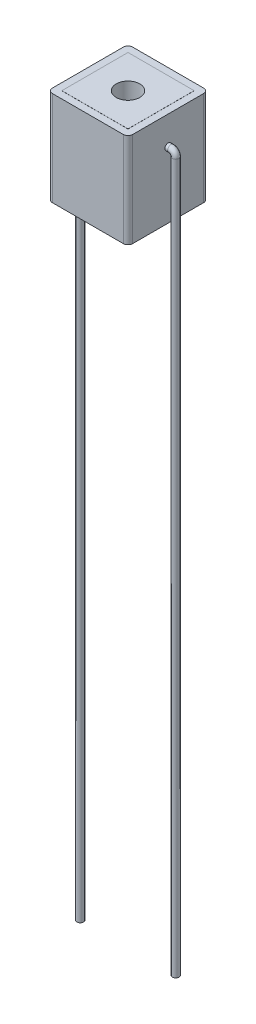
ISO-10303-21;
HEADER;
FILE_DESCRIPTION(('STEP AP214'),'2;1');
FILE_NAME('part.step','',(''),(''),'','','');
FILE_SCHEMA(('AUTOMOTIVE_DESIGN { 1 0 10303 214 1 1 1 1 }'));
ENDSEC;
DATA;
#1=APPLICATION_CONTEXT('core data for automotive mechanical design processes');
#2=APPLICATION_PROTOCOL_DEFINITION('international standard','automotive_design',2000,#1);
#3=PRODUCT_CONTEXT('',#1,'mechanical');
#4=PRODUCT('Part','Part','',(#3));
#5=PRODUCT_RELATED_PRODUCT_CATEGORY('part','',(#4));
#6=PRODUCT_DEFINITION_FORMATION('','',#4);
#7=PRODUCT_DEFINITION_CONTEXT('part definition',#1,'design');
#8=PRODUCT_DEFINITION('design','',#6,#7);
#9=PRODUCT_DEFINITION_SHAPE('','',#8);
#10=(LENGTH_UNIT() NAMED_UNIT(*) SI_UNIT(.MILLI.,.METRE.));
#11=(NAMED_UNIT(*) PLANE_ANGLE_UNIT() SI_UNIT($,.RADIAN.));
#12=(NAMED_UNIT(*) SI_UNIT($,.STERADIAN.) SOLID_ANGLE_UNIT());
#13=UNCERTAINTY_MEASURE_WITH_UNIT(LENGTH_MEASURE(1.E-05),#10,'distance_accuracy_value','');
#14=(GEOMETRIC_REPRESENTATION_CONTEXT(3) GLOBAL_UNCERTAINTY_ASSIGNED_CONTEXT((#13)) GLOBAL_UNIT_ASSIGNED_CONTEXT((#10,
#11,#12)) REPRESENTATION_CONTEXT('',''));
#15=CARTESIAN_POINT('',(0.,0.,0.));
#16=DIRECTION('',(0.,0.,1.));
#17=DIRECTION('',(1.,0.,0.));
#18=AXIS2_PLACEMENT_3D('',#15,#16,#17);
#19=CARTESIAN_POINT('',(4.25,10.,-4.25));
#20=DIRECTION('',(-1.,0.,0.));
#21=DIRECTION('',(0.,0.,1.));
#22=AXIS2_PLACEMENT_3D('',#19,#20,#21);
#23=PLANE('',#22);
#24=CARTESIAN_POINT('',(4.25,7.,0.));
#25=DIRECTION('',(-1.,0.,0.));
#26=DIRECTION('',(0.,0.,1.));
#27=AXIS2_PLACEMENT_3D('',#24,#25,#26);
#28=CIRCLE('',#27,0.35);
#29=CARTESIAN_POINT('',(4.25,7.,0.35));
#30=VERTEX_POINT('',#29);
#31=EDGE_CURVE('E86',#30,#30,#28,.F.);
#32=ORIENTED_EDGE('',*,*,#31,.F.);
#33=EDGE_LOOP('',(#32));
#34=FACE_BOUND('',#33,.T.);
#35=DIRECTION('',(0.,0.,-1.));
#36=VECTOR('',#35,1.);
#37=CARTESIAN_POINT('',(4.25,10.,-4.25));
#38=LINE('',#37,#36);
#39=CARTESIAN_POINT('',(4.25,10.,3.75));
#40=VERTEX_POINT('',#39);
#41=CARTESIAN_POINT('',(4.25,10.,-3.75));
#42=VERTEX_POINT('',#41);
#43=EDGE_CURVE('E299',#40,#42,#38,.T.);
#44=ORIENTED_EDGE('',*,*,#43,.F.);
#45=DIRECTION('',(0.,-1.,0.));
#46=VECTOR('',#45,1.);
#47=CARTESIAN_POINT('',(4.25,10.,3.75));
#48=LINE('',#47,#46);
#49=CARTESIAN_POINT('',(4.25,0.,3.75));
#50=VERTEX_POINT('',#49);
#51=EDGE_CURVE('E345',#40,#50,#48,.T.);
#52=ORIENTED_EDGE('',*,*,#51,.T.);
#53=DIRECTION('',(0.,0.,-1.));
#54=VECTOR('',#53,1.);
#55=CARTESIAN_POINT('',(4.25,0.,-4.25));
#56=LINE('',#55,#54);
#57=CARTESIAN_POINT('',(4.25,0.,-3.75));
#58=VERTEX_POINT('',#57);
#59=EDGE_CURVE('E298',#50,#58,#56,.T.);
#60=ORIENTED_EDGE('',*,*,#59,.T.);
#61=DIRECTION('',(0.,-1.,0.));
#62=VECTOR('',#61,1.);
#63=CARTESIAN_POINT('',(4.25,10.,-3.75));
#64=LINE('',#63,#62);
#65=EDGE_CURVE('E342',#58,#42,#64,.F.);
#66=ORIENTED_EDGE('',*,*,#65,.T.);
#67=EDGE_LOOP('',(#44,#52,#60,#66));
#68=FACE_BOUND('',#67,.T.);
#69=ADVANCED_FACE('F77',(#34,#68),#23,.F.);
#70=CARTESIAN_POINT('',(-4.25,10.,-4.25));
#71=DIRECTION('',(0.,0.,1.));
#72=DIRECTION('',(1.,0.,0.));
#73=AXIS2_PLACEMENT_3D('',#70,#71,#72);
#74=PLANE('',#73);
#75=DIRECTION('',(-1.,0.,0.));
#76=VECTOR('',#75,1.);
#77=CARTESIAN_POINT('',(-4.25,0.,-4.25));
#78=LINE('',#77,#76);
#79=CARTESIAN_POINT('',(3.75,0.,-4.25));
#80=VERTEX_POINT('',#79);
#81=CARTESIAN_POINT('',(-3.75,0.,-4.25));
#82=VERTEX_POINT('',#81);
#83=EDGE_CURVE('E317',#80,#82,#78,.T.);
#84=ORIENTED_EDGE('',*,*,#83,.T.);
#85=DIRECTION('',(0.,-1.,0.));
#86=VECTOR('',#85,1.);
#87=CARTESIAN_POINT('',(-3.75,10.,-4.25));
#88=LINE('',#87,#86);
#89=CARTESIAN_POINT('',(-3.75,10.,-4.25));
#90=VERTEX_POINT('',#89);
#91=EDGE_CURVE('E389',#82,#90,#88,.F.);
#92=ORIENTED_EDGE('',*,*,#91,.T.);
#93=DIRECTION('',(-1.,0.,0.));
#94=VECTOR('',#93,1.);
#95=CARTESIAN_POINT('',(-4.25,10.,-4.25));
#96=LINE('',#95,#94);
#97=CARTESIAN_POINT('',(3.75,10.,-4.25));
#98=VERTEX_POINT('',#97);
#99=EDGE_CURVE('E303',#98,#90,#96,.T.);
#100=ORIENTED_EDGE('',*,*,#99,.F.);
#101=DIRECTION('',(0.,-1.,0.));
#102=VECTOR('',#101,1.);
#103=CARTESIAN_POINT('',(3.75,10.,-4.25));
#104=LINE('',#103,#102);
#105=EDGE_CURVE('E385',#98,#80,#104,.T.);
#106=ORIENTED_EDGE('',*,*,#105,.T.);
#107=EDGE_LOOP('',(#84,#92,#100,#106));
#108=FACE_BOUND('',#107,.T.);
#109=ADVANCED_FACE('F399',(#108),#74,.F.);
#110=CARTESIAN_POINT('',(-4.25,10.,-4.25));
#111=DIRECTION('',(1.,0.,0.));
#112=DIRECTION('',(0.,0.,-1.));
#113=AXIS2_PLACEMENT_3D('',#110,#111,#112);
#114=PLANE('',#113);
#115=CARTESIAN_POINT('',(-4.25,7.,0.));
#116=DIRECTION('',(1.,0.,0.));
#117=DIRECTION('',(0.,0.,-1.));
#118=AXIS2_PLACEMENT_3D('',#115,#116,#117);
#119=CIRCLE('',#118,0.35);
#120=CARTESIAN_POINT('',(-4.25,7.,-0.35));
#121=VERTEX_POINT('',#120);
#122=EDGE_CURVE('E14',#121,#121,#119,.F.);
#123=ORIENTED_EDGE('',*,*,#122,.F.);
#124=EDGE_LOOP('',(#123));
#125=FACE_BOUND('',#124,.T.);
#126=DIRECTION('',(0.,0.,1.));
#127=VECTOR('',#126,1.);
#128=CARTESIAN_POINT('',(-4.25,0.,-4.25));
#129=LINE('',#128,#127);
#130=CARTESIAN_POINT('',(-4.25,0.,-3.75));
#131=VERTEX_POINT('',#130);
#132=CARTESIAN_POINT('',(-4.25,0.,3.75));
#133=VERTEX_POINT('',#132);
#134=EDGE_CURVE('E321',#131,#133,#129,.T.);
#135=ORIENTED_EDGE('',*,*,#134,.T.);
#136=DIRECTION('',(0.,-1.,0.));
#137=VECTOR('',#136,1.);
#138=CARTESIAN_POINT('',(-4.25,10.,3.75));
#139=LINE('',#138,#137);
#140=CARTESIAN_POINT('',(-4.25,10.,3.75));
#141=VERTEX_POINT('',#140);
#142=EDGE_CURVE('E93',#133,#141,#139,.F.);
#143=ORIENTED_EDGE('',*,*,#142,.T.);
#144=DIRECTION('',(0.,0.,1.));
#145=VECTOR('',#144,1.);
#146=CARTESIAN_POINT('',(-4.25,10.,-4.25));
#147=LINE('',#146,#145);
#148=CARTESIAN_POINT('',(-4.25,10.,-3.75));
#149=VERTEX_POINT('',#148);
#150=EDGE_CURVE('E306',#149,#141,#147,.T.);
#151=ORIENTED_EDGE('',*,*,#150,.F.);
#152=DIRECTION('',(0.,-1.,0.));
#153=VECTOR('',#152,1.);
#154=CARTESIAN_POINT('',(-4.25,10.,-3.75));
#155=LINE('',#154,#153);
#156=EDGE_CURVE('E379',#149,#131,#155,.T.);
#157=ORIENTED_EDGE('',*,*,#156,.T.);
#158=EDGE_LOOP('',(#135,#143,#151,#157));
#159=FACE_BOUND('',#158,.T.);
#160=ADVANCED_FACE('F421',(#125,#159),#114,.F.);
#161=CARTESIAN_POINT('',(-4.25,10.,4.25));
#162=DIRECTION('',(0.,0.,-1.));
#163=DIRECTION('',(-1.,0.,0.));
#164=AXIS2_PLACEMENT_3D('',#161,#162,#163);
#165=PLANE('',#164);
#166=DIRECTION('',(1.,0.,0.));
#167=VECTOR('',#166,1.);
#168=CARTESIAN_POINT('',(-4.25,0.,4.25));
#169=LINE('',#168,#167);
#170=CARTESIAN_POINT('',(-3.75,0.,4.25));
#171=VERTEX_POINT('',#170);
#172=CARTESIAN_POINT('',(3.75,0.,4.25));
#173=VERTEX_POINT('',#172);
#174=EDGE_CURVE('E304',#171,#173,#169,.T.);
#175=ORIENTED_EDGE('',*,*,#174,.T.);
#176=DIRECTION('',(0.,-1.,0.));
#177=VECTOR('',#176,1.);
#178=CARTESIAN_POINT('',(3.75,10.,4.25));
#179=LINE('',#178,#177);
#180=CARTESIAN_POINT('',(3.75,10.,4.25));
#181=VERTEX_POINT('',#180);
#182=EDGE_CURVE('E365',#173,#181,#179,.F.);
#183=ORIENTED_EDGE('',*,*,#182,.T.);
#184=DIRECTION('',(1.,0.,0.));
#185=VECTOR('',#184,1.);
#186=CARTESIAN_POINT('',(-4.25,10.,4.25));
#187=LINE('',#186,#185);
#188=CARTESIAN_POINT('',(-3.75,10.,4.25));
#189=VERTEX_POINT('',#188);
#190=EDGE_CURVE('E309',#189,#181,#187,.T.);
#191=ORIENTED_EDGE('',*,*,#190,.F.);
#192=DIRECTION('',(0.,-1.,0.));
#193=VECTOR('',#192,1.);
#194=CARTESIAN_POINT('',(-3.75,10.,4.25));
#195=LINE('',#194,#193);
#196=EDGE_CURVE('E361',#189,#171,#195,.T.);
#197=ORIENTED_EDGE('',*,*,#196,.T.);
#198=EDGE_LOOP('',(#175,#183,#191,#197));
#199=FACE_BOUND('',#198,.T.);
#200=ADVANCED_FACE('F414',(#199),#165,.F.);
#201=CARTESIAN_POINT('',(0.,10.,0.));
#202=DIRECTION('',(0.,1.,0.));
#203=DIRECTION('',(0.,0.,1.));
#204=AXIS2_PLACEMENT_3D('',#201,#202,#203);
#205=PLANE('',#204);
#206=DIRECTION('',(0.,0.,-1.));
#207=VECTOR('',#206,1.);
#208=CARTESIAN_POINT('',(3.5,10.,0.));
#209=LINE('',#208,#207);
#210=CARTESIAN_POINT('',(3.5,10.,3.5));
#211=VERTEX_POINT('',#210);
#212=CARTESIAN_POINT('',(3.5,10.,-3.5));
#213=VERTEX_POINT('',#212);
#214=EDGE_CURVE('E294',#211,#213,#209,.T.);
#215=ORIENTED_EDGE('',*,*,#214,.F.);
#216=DIRECTION('',(1.,0.,0.));
#217=VECTOR('',#216,1.);
#218=CARTESIAN_POINT('',(0.,10.,3.5));
#219=LINE('',#218,#217);
#220=CARTESIAN_POINT('',(-3.5,10.,3.5));
#221=VERTEX_POINT('',#220);
#222=EDGE_CURVE('E290',#221,#211,#219,.T.);
#223=ORIENTED_EDGE('',*,*,#222,.F.);
#224=DIRECTION('',(0.,0.,1.));
#225=VECTOR('',#224,1.);
#226=CARTESIAN_POINT('',(-3.5,10.,0.));
#227=LINE('',#226,#225);
#228=CARTESIAN_POINT('',(-3.5,10.,-3.5));
#229=VERTEX_POINT('',#228);
#230=EDGE_CURVE('E286',#229,#221,#227,.T.);
#231=ORIENTED_EDGE('',*,*,#230,.F.);
#232=DIRECTION('',(-1.,0.,0.));
#233=VECTOR('',#232,1.);
#234=CARTESIAN_POINT('',(0.,10.,-3.5));
#235=LINE('',#234,#233);
#236=EDGE_CURVE('E268',#213,#229,#235,.T.);
#237=ORIENTED_EDGE('',*,*,#236,.F.);
#238=EDGE_LOOP('',(#215,#223,#231,#237));
#239=FACE_BOUND('',#238,.T.);
#240=ORIENTED_EDGE('',*,*,#190,.T.);
#241=CARTESIAN_POINT('',(3.75,10.,3.75));
#242=DIRECTION('',(0.,1.,0.));
#243=DIRECTION('',(0.,0.,1.));
#244=AXIS2_PLACEMENT_3D('',#241,#242,#243);
#245=CIRCLE('',#244,0.5);
#246=EDGE_CURVE('E376',#181,#40,#245,.T.);
#247=ORIENTED_EDGE('',*,*,#246,.T.);
#248=ORIENTED_EDGE('',*,*,#43,.T.);
#249=CARTESIAN_POINT('',(3.75,10.,-3.75));
#250=DIRECTION('',(0.,1.,0.));
#251=DIRECTION('',(0.,0.,1.));
#252=AXIS2_PLACEMENT_3D('',#249,#250,#251);
#253=CIRCLE('',#252,0.5);
#254=EDGE_CURVE('E368',#42,#98,#253,.T.);
#255=ORIENTED_EDGE('',*,*,#254,.T.);
#256=ORIENTED_EDGE('',*,*,#99,.T.);
#257=CARTESIAN_POINT('',(-3.75,10.,-3.75));
#258=DIRECTION('',(0.,1.,0.));
#259=DIRECTION('',(0.,0.,1.));
#260=AXIS2_PLACEMENT_3D('',#257,#258,#259);
#261=CIRCLE('',#260,0.5);
#262=EDGE_CURVE('E100',#90,#149,#261,.T.);
#263=ORIENTED_EDGE('',*,*,#262,.T.);
#264=ORIENTED_EDGE('',*,*,#150,.T.);
#265=CARTESIAN_POINT('',(-3.75,10.,3.75));
#266=DIRECTION('',(0.,1.,0.));
#267=DIRECTION('',(0.,0.,1.));
#268=AXIS2_PLACEMENT_3D('',#265,#266,#267);
#269=CIRCLE('',#268,0.5);
#270=EDGE_CURVE('E373',#141,#189,#269,.T.);
#271=ORIENTED_EDGE('',*,*,#270,.T.);
#272=EDGE_LOOP('',(#240,#247,#248,#255,#256,#263,#264,#271));
#273=FACE_BOUND('',#272,.T.);
#274=ADVANCED_FACE('F431',(#239,#273),#205,.T.);
#275=CARTESIAN_POINT('',(0.,0.,0.));
#276=DIRECTION('',(0.,1.,0.));
#277=DIRECTION('',(0.,0.,1.));
#278=AXIS2_PLACEMENT_3D('',#275,#276,#277);
#279=PLANE('',#278);
#280=DIRECTION('',(1.,0.,0.));
#281=VECTOR('',#280,1.);
#282=CARTESIAN_POINT('',(0.,0.,3.5));
#283=LINE('',#282,#281);
#284=CARTESIAN_POINT('',(-3.5,0.,3.5));
#285=VERTEX_POINT('',#284);
#286=CARTESIAN_POINT('',(3.5,0.,3.5));
#287=VERTEX_POINT('',#286);
#288=EDGE_CURVE('E334',#285,#287,#283,.T.);
#289=ORIENTED_EDGE('',*,*,#288,.T.);
#290=DIRECTION('',(0.,0.,-1.));
#291=VECTOR('',#290,1.);
#292=CARTESIAN_POINT('',(3.5,0.,0.));
#293=LINE('',#292,#291);
#294=CARTESIAN_POINT('',(3.5,0.,-3.5));
#295=VERTEX_POINT('',#294);
#296=EDGE_CURVE('E338',#287,#295,#293,.T.);
#297=ORIENTED_EDGE('',*,*,#296,.T.);
#298=DIRECTION('',(-1.,0.,0.));
#299=VECTOR('',#298,1.);
#300=CARTESIAN_POINT('',(0.,0.,-3.5));
#301=LINE('',#300,#299);
#302=CARTESIAN_POINT('',(-3.5,0.,-3.5));
#303=VERTEX_POINT('',#302);
#304=EDGE_CURVE('E313',#295,#303,#301,.T.);
#305=ORIENTED_EDGE('',*,*,#304,.T.);
#306=DIRECTION('',(0.,0.,1.));
#307=VECTOR('',#306,1.);
#308=CARTESIAN_POINT('',(-3.5,0.,0.));
#309=LINE('',#308,#307);
#310=EDGE_CURVE('E330',#303,#285,#309,.T.);
#311=ORIENTED_EDGE('',*,*,#310,.T.);
#312=EDGE_LOOP('',(#289,#297,#305,#311));
#313=FACE_BOUND('',#312,.T.);
#314=ORIENTED_EDGE('',*,*,#59,.F.);
#315=CARTESIAN_POINT('',(3.75,0.,3.75));
#316=DIRECTION('',(0.,1.,0.));
#317=DIRECTION('',(0.,0.,1.));
#318=AXIS2_PLACEMENT_3D('',#315,#316,#317);
#319=CIRCLE('',#318,0.5);
#320=EDGE_CURVE('E358',#50,#173,#319,.F.);
#321=ORIENTED_EDGE('',*,*,#320,.T.);
#322=ORIENTED_EDGE('',*,*,#174,.F.);
#323=CARTESIAN_POINT('',(-3.75,0.,3.75));
#324=DIRECTION('',(0.,1.,0.));
#325=DIRECTION('',(0.,0.,1.));
#326=AXIS2_PLACEMENT_3D('',#323,#324,#325);
#327=CIRCLE('',#326,0.5);
#328=EDGE_CURVE('E355',#171,#133,#327,.F.);
#329=ORIENTED_EDGE('',*,*,#328,.T.);
#330=ORIENTED_EDGE('',*,*,#134,.F.);
#331=CARTESIAN_POINT('',(-3.75,0.,-3.75));
#332=DIRECTION('',(0.,1.,0.));
#333=DIRECTION('',(0.,0.,1.));
#334=AXIS2_PLACEMENT_3D('',#331,#332,#333);
#335=CIRCLE('',#334,0.5);
#336=EDGE_CURVE('E352',#131,#82,#335,.F.);
#337=ORIENTED_EDGE('',*,*,#336,.T.);
#338=ORIENTED_EDGE('',*,*,#83,.F.);
#339=CARTESIAN_POINT('',(3.75,0.,-3.75));
#340=DIRECTION('',(0.,1.,0.));
#341=DIRECTION('',(0.,0.,1.));
#342=AXIS2_PLACEMENT_3D('',#339,#340,#341);
#343=CIRCLE('',#342,0.5);
#344=EDGE_CURVE('E349',#80,#58,#343,.F.);
#345=ORIENTED_EDGE('',*,*,#344,.T.);
#346=EDGE_LOOP('',(#314,#321,#322,#329,#330,#337,#338,#345));
#347=FACE_BOUND('',#346,.T.);
#348=ADVANCED_FACE('F412',(#313,#347),#279,.F.);
#349=CARTESIAN_POINT('',(0.,-0.01,0.));
#350=DIRECTION('',(0.,1.,0.));
#351=DIRECTION('',(0.,0.,1.));
#352=AXIS2_PLACEMENT_3D('',#349,#350,#351);
#353=PLANE('',#352);
#354=CARTESIAN_POINT('',(0.,-0.00999999999999959,0.));
#355=DIRECTION('',(0.,1.,0.));
#356=DIRECTION('',(0.,0.,1.));
#357=AXIS2_PLACEMENT_3D('',#354,#355,#356);
#358=CIRCLE('',#357,1.25);
#359=CARTESIAN_POINT('',(0.,-0.00999999999999959,1.25));
#360=VERTEX_POINT('',#359);
#361=EDGE_CURVE('E228',#360,#360,#358,.T.);
#362=ORIENTED_EDGE('',*,*,#361,.T.);
#363=EDGE_LOOP('',(#362));
#364=FACE_BOUND('',#363,.T.);
#365=DIRECTION('',(0.,0.,-1.));
#366=VECTOR('',#365,1.);
#367=CARTESIAN_POINT('',(3.5,-0.01,-3.5));
#368=LINE('',#367,#366);
#369=CARTESIAN_POINT('',(3.5,-0.01,3.5));
#370=VERTEX_POINT('',#369);
#371=CARTESIAN_POINT('',(3.5,-0.01,-3.5));
#372=VERTEX_POINT('',#371);
#373=EDGE_CURVE('E248',#370,#372,#368,.T.);
#374=ORIENTED_EDGE('',*,*,#373,.F.);
#375=DIRECTION('',(1.,0.,0.));
#376=VECTOR('',#375,1.);
#377=CARTESIAN_POINT('',(-3.5,-0.01,3.5));
#378=LINE('',#377,#376);
#379=CARTESIAN_POINT('',(-3.5,-0.01,3.5));
#380=VERTEX_POINT('',#379);
#381=EDGE_CURVE('E259',#380,#370,#378,.T.);
#382=ORIENTED_EDGE('',*,*,#381,.F.);
#383=DIRECTION('',(0.,0.,1.));
#384=VECTOR('',#383,1.);
#385=CARTESIAN_POINT('',(-3.5,-0.01,-3.5));
#386=LINE('',#385,#384);
#387=CARTESIAN_POINT('',(-3.5,-0.01,-3.5));
#388=VERTEX_POINT('',#387);
#389=EDGE_CURVE('E256',#388,#380,#386,.T.);
#390=ORIENTED_EDGE('',*,*,#389,.F.);
#391=DIRECTION('',(-1.,0.,0.));
#392=VECTOR('',#391,1.);
#393=CARTESIAN_POINT('',(-3.5,-0.01,-3.5));
#394=LINE('',#393,#392);
#395=EDGE_CURVE('E252',#372,#388,#394,.T.);
#396=ORIENTED_EDGE('',*,*,#395,.F.);
#397=EDGE_LOOP('',(#374,#382,#390,#396));
#398=FACE_BOUND('',#397,.T.);
#399=ADVANCED_FACE('F439',(#364,#398),#353,.F.);
#400=CARTESIAN_POINT('',(-3.5,-0.01,-3.5));
#401=DIRECTION('',(0.,0.,-1.));
#402=DIRECTION('',(-1.,0.,0.));
#403=AXIS2_PLACEMENT_3D('',#400,#401,#402);
#404=PLANE('',#403);
#405=ORIENTED_EDGE('',*,*,#304,.F.);
#406=DIRECTION('',(0.,1.,0.));
#407=VECTOR('',#406,1.);
#408=CARTESIAN_POINT('',(3.5,-0.01,-3.5));
#409=LINE('',#408,#407);
#410=EDGE_CURVE('E279',#372,#295,#409,.T.);
#411=ORIENTED_EDGE('',*,*,#410,.F.);
#412=ORIENTED_EDGE('',*,*,#395,.T.);
#413=DIRECTION('',(0.,1.,0.));
#414=VECTOR('',#413,1.);
#415=CARTESIAN_POINT('',(-3.5,-0.01,-3.5));
#416=LINE('',#415,#414);
#417=EDGE_CURVE('E275',#388,#303,#416,.T.);
#418=ORIENTED_EDGE('',*,*,#417,.T.);
#419=EDGE_LOOP('',(#405,#411,#412,#418));
#420=FACE_BOUND('',#419,.T.);
#421=ADVANCED_FACE('F551',(#420),#404,.T.);
#422=CARTESIAN_POINT('',(-3.5,-0.01,-3.5));
#423=DIRECTION('',(-1.,0.,0.));
#424=DIRECTION('',(0.,0.,1.));
#425=AXIS2_PLACEMENT_3D('',#422,#423,#424);
#426=PLANE('',#425);
#427=ORIENTED_EDGE('',*,*,#310,.F.);
#428=ORIENTED_EDGE('',*,*,#417,.F.);
#429=ORIENTED_EDGE('',*,*,#389,.T.);
#430=DIRECTION('',(0.,1.,0.));
#431=VECTOR('',#430,1.);
#432=CARTESIAN_POINT('',(-3.5,-0.01,3.5));
#433=LINE('',#432,#431);
#434=EDGE_CURVE('E270',#380,#285,#433,.T.);
#435=ORIENTED_EDGE('',*,*,#434,.T.);
#436=EDGE_LOOP('',(#427,#428,#429,#435));
#437=FACE_BOUND('',#436,.T.);
#438=ADVANCED_FACE('F541',(#437),#426,.T.);
#439=CARTESIAN_POINT('',(-3.5,-0.01,3.5));
#440=DIRECTION('',(0.,0.,1.));
#441=DIRECTION('',(1.,0.,0.));
#442=AXIS2_PLACEMENT_3D('',#439,#440,#441);
#443=PLANE('',#442);
#444=ORIENTED_EDGE('',*,*,#288,.F.);
#445=ORIENTED_EDGE('',*,*,#434,.F.);
#446=ORIENTED_EDGE('',*,*,#381,.T.);
#447=DIRECTION('',(0.,1.,0.));
#448=VECTOR('',#447,1.);
#449=CARTESIAN_POINT('',(3.5,-0.01,3.5));
#450=LINE('',#449,#448);
#451=EDGE_CURVE('E264',#370,#287,#450,.T.);
#452=ORIENTED_EDGE('',*,*,#451,.T.);
#453=EDGE_LOOP('',(#444,#445,#446,#452));
#454=FACE_BOUND('',#453,.T.);
#455=ADVANCED_FACE('F536',(#454),#443,.T.);
#456=CARTESIAN_POINT('',(3.5,-0.01,-3.5));
#457=DIRECTION('',(1.,0.,0.));
#458=DIRECTION('',(0.,0.,-1.));
#459=AXIS2_PLACEMENT_3D('',#456,#457,#458);
#460=PLANE('',#459);
#461=ORIENTED_EDGE('',*,*,#296,.F.);
#462=ORIENTED_EDGE('',*,*,#451,.F.);
#463=ORIENTED_EDGE('',*,*,#373,.T.);
#464=ORIENTED_EDGE('',*,*,#410,.T.);
#465=EDGE_LOOP('',(#461,#462,#463,#464));
#466=FACE_BOUND('',#465,.T.);
#467=ADVANCED_FACE('F530',(#466),#460,.T.);
#468=CARTESIAN_POINT('',(3.5,10.01,3.5));
#469=VERTEX_POINT('',#468);
#470=EDGE_CURVE('E269',#211,#469,#450,.T.);
#471=ORIENTED_EDGE('',*,*,#470,.F.);
#472=ORIENTED_EDGE('',*,*,#214,.T.);
#473=CARTESIAN_POINT('',(3.5,10.01,-3.5));
#474=VERTEX_POINT('',#473);
#475=EDGE_CURVE('E263',#213,#474,#409,.T.);
#476=ORIENTED_EDGE('',*,*,#475,.T.);
#477=DIRECTION('',(0.,0.,-1.));
#478=VECTOR('',#477,1.);
#479=CARTESIAN_POINT('',(3.5,10.01,-3.5));
#480=LINE('',#479,#478);
#481=EDGE_CURVE('E232',#469,#474,#480,.T.);
#482=ORIENTED_EDGE('',*,*,#481,.F.);
#483=EDGE_LOOP('',(#471,#472,#476,#482));
#484=FACE_BOUND('',#483,.T.);
#485=ADVANCED_FACE('F444',(#484),#460,.T.);
#486=CARTESIAN_POINT('',(-3.5,10.01,3.5));
#487=VERTEX_POINT('',#486);
#488=EDGE_CURVE('E274',#221,#487,#433,.T.);
#489=ORIENTED_EDGE('',*,*,#488,.F.);
#490=ORIENTED_EDGE('',*,*,#222,.T.);
#491=ORIENTED_EDGE('',*,*,#470,.T.);
#492=DIRECTION('',(1.,0.,0.));
#493=VECTOR('',#492,1.);
#494=CARTESIAN_POINT('',(-3.5,10.01,3.5));
#495=LINE('',#494,#493);
#496=EDGE_CURVE('E244',#487,#469,#495,.T.);
#497=ORIENTED_EDGE('',*,*,#496,.F.);
#498=EDGE_LOOP('',(#489,#490,#491,#497));
#499=FACE_BOUND('',#498,.T.);
#500=ADVANCED_FACE('F520',(#499),#443,.T.);
#501=CARTESIAN_POINT('',(-3.5,10.01,-3.5));
#502=VERTEX_POINT('',#501);
#503=EDGE_CURVE('E278',#229,#502,#416,.T.);
#504=ORIENTED_EDGE('',*,*,#503,.F.);
#505=ORIENTED_EDGE('',*,*,#230,.T.);
#506=ORIENTED_EDGE('',*,*,#488,.T.);
#507=DIRECTION('',(0.,0.,1.));
#508=VECTOR('',#507,1.);
#509=CARTESIAN_POINT('',(-3.5,10.01,-3.5));
#510=LINE('',#509,#508);
#511=EDGE_CURVE('E240',#502,#487,#510,.T.);
#512=ORIENTED_EDGE('',*,*,#511,.F.);
#513=EDGE_LOOP('',(#504,#505,#506,#512));
#514=FACE_BOUND('',#513,.T.);
#515=ADVANCED_FACE('F514',(#514),#426,.T.);
#516=ORIENTED_EDGE('',*,*,#475,.F.);
#517=ORIENTED_EDGE('',*,*,#236,.T.);
#518=ORIENTED_EDGE('',*,*,#503,.T.);
#519=DIRECTION('',(-1.,0.,0.));
#520=VECTOR('',#519,1.);
#521=CARTESIAN_POINT('',(-3.5,10.01,-3.5));
#522=LINE('',#521,#520);
#523=EDGE_CURVE('E236',#474,#502,#522,.T.);
#524=ORIENTED_EDGE('',*,*,#523,.F.);
#525=EDGE_LOOP('',(#516,#517,#518,#524));
#526=FACE_BOUND('',#525,.T.);
#527=ADVANCED_FACE('F527',(#526),#404,.T.);
#528=CARTESIAN_POINT('',(0.,10.01,0.));
#529=DIRECTION('',(0.,1.,0.));
#530=DIRECTION('',(0.,0.,1.));
#531=AXIS2_PLACEMENT_3D('',#528,#529,#530);
#532=PLANE('',#531);
#533=CARTESIAN_POINT('',(0.,10.01,0.));
#534=DIRECTION('',(0.,1.,0.));
#535=DIRECTION('',(0.,0.,1.));
#536=AXIS2_PLACEMENT_3D('',#533,#534,#535);
#537=CIRCLE('',#536,1.25);
#538=CARTESIAN_POINT('',(0.,10.01,1.25));
#539=VERTEX_POINT('',#538);
#540=EDGE_CURVE('E224',#539,#539,#537,.T.);
#541=ORIENTED_EDGE('',*,*,#540,.F.);
#542=EDGE_LOOP('',(#541));
#543=FACE_BOUND('',#542,.T.);
#544=ORIENTED_EDGE('',*,*,#481,.T.);
#545=ORIENTED_EDGE('',*,*,#523,.T.);
#546=ORIENTED_EDGE('',*,*,#511,.T.);
#547=ORIENTED_EDGE('',*,*,#496,.T.);
#548=EDGE_LOOP('',(#544,#545,#546,#547));
#549=FACE_BOUND('',#548,.T.);
#550=ADVANCED_FACE('F454',(#543,#549),#532,.T.);
#551=CARTESIAN_POINT('',(3.75,10.,3.75));
#552=DIRECTION('',(0.,-1.,0.));
#553=DIRECTION('',(0.,0.,-1.));
#554=AXIS2_PLACEMENT_3D('',#551,#552,#553);
#555=CYLINDRICAL_SURFACE('',#554,0.5);
#556=ORIENTED_EDGE('',*,*,#246,.F.);
#557=ORIENTED_EDGE('',*,*,#182,.F.);
#558=ORIENTED_EDGE('',*,*,#320,.F.);
#559=ORIENTED_EDGE('',*,*,#51,.F.);
#560=EDGE_LOOP('',(#556,#557,#558,#559));
#561=FACE_BOUND('',#560,.T.);
#562=ADVANCED_FACE('F408',(#561),#555,.T.);
#563=CARTESIAN_POINT('',(-3.75,10.,3.75));
#564=DIRECTION('',(0.,-1.,0.));
#565=DIRECTION('',(0.,0.,-1.));
#566=AXIS2_PLACEMENT_3D('',#563,#564,#565);
#567=CYLINDRICAL_SURFACE('',#566,0.5);
#568=ORIENTED_EDGE('',*,*,#270,.F.);
#569=ORIENTED_EDGE('',*,*,#142,.F.);
#570=ORIENTED_EDGE('',*,*,#328,.F.);
#571=ORIENTED_EDGE('',*,*,#196,.F.);
#572=EDGE_LOOP('',(#568,#569,#570,#571));
#573=FACE_BOUND('',#572,.T.);
#574=ADVANCED_FACE('F419',(#573),#567,.T.);
#575=CARTESIAN_POINT('',(-3.75,10.,-3.75));
#576=DIRECTION('',(0.,-1.,0.));
#577=DIRECTION('',(0.,0.,-1.));
#578=AXIS2_PLACEMENT_3D('',#575,#576,#577);
#579=CYLINDRICAL_SURFACE('',#578,0.5);
#580=ORIENTED_EDGE('',*,*,#262,.F.);
#581=ORIENTED_EDGE('',*,*,#91,.F.);
#582=ORIENTED_EDGE('',*,*,#336,.F.);
#583=ORIENTED_EDGE('',*,*,#156,.F.);
#584=EDGE_LOOP('',(#580,#581,#582,#583));
#585=FACE_BOUND('',#584,.T.);
#586=ADVANCED_FACE('F424',(#585),#579,.T.);
#587=CARTESIAN_POINT('',(3.75,10.,-3.75));
#588=DIRECTION('',(0.,-1.,0.));
#589=DIRECTION('',(0.,0.,-1.));
#590=AXIS2_PLACEMENT_3D('',#587,#588,#589);
#591=CYLINDRICAL_SURFACE('',#590,0.5);
#592=ORIENTED_EDGE('',*,*,#254,.F.);
#593=ORIENTED_EDGE('',*,*,#65,.F.);
#594=ORIENTED_EDGE('',*,*,#344,.F.);
#595=ORIENTED_EDGE('',*,*,#105,.F.);
#596=EDGE_LOOP('',(#592,#593,#594,#595));
#597=FACE_BOUND('',#596,.T.);
#598=ADVANCED_FACE('F79',(#597),#591,.T.);
#599=CARTESIAN_POINT('',(0.,-9.99,0.));
#600=DIRECTION('',(0.,1.,0.));
#601=DIRECTION('',(0.,0.,1.));
#602=AXIS2_PLACEMENT_3D('',#599,#600,#601);
#603=CYLINDRICAL_SURFACE('',#602,1.25);
#604=ORIENTED_EDGE('',*,*,#540,.T.);
#605=EDGE_LOOP('',(#604));
#606=FACE_BOUND('',#605,.T.);
#607=ORIENTED_EDGE('',*,*,#361,.F.);
#608=EDGE_LOOP('',(#607));
#609=FACE_BOUND('',#608,.T.);
#610=ADVANCED_FACE('F460',(#606,#609),#603,.F.);
#611=CARTESIAN_POINT('',(5.05000000000001,-68.5,0.));
#612=DIRECTION('',(0.,1.,0.));
#613=DIRECTION('',(-1.,0.,0.));
#614=AXIS2_PLACEMENT_3D('',#611,#612,#613);
#615=PLANE('',#614);
#616=CARTESIAN_POINT('',(5.05000000000001,-68.5,0.));
#617=DIRECTION('',(0.,1.,0.));
#618=DIRECTION('',(-1.,0.,0.));
#619=AXIS2_PLACEMENT_3D('',#616,#617,#618);
#620=CIRCLE('',#619,0.35);
#621=CARTESIAN_POINT('',(4.70000000000001,-68.5,0.));
#622=VERTEX_POINT('',#621);
#623=EDGE_CURVE('E221',#622,#622,#620,.T.);
#624=ORIENTED_EDGE('',*,*,#623,.F.);
#625=EDGE_LOOP('',(#624));
#626=FACE_BOUND('',#625,.T.);
#627=ADVANCED_FACE('F464',(#626),#615,.F.);
#628=CARTESIAN_POINT('',(4.25,7.,0.));
#629=DIRECTION('',(1.,0.,0.));
#630=DIRECTION('',(0.,0.,-1.));
#631=AXIS2_PLACEMENT_3D('',#628,#629,#630);
#632=CYLINDRICAL_SURFACE('',#631,0.35);
#633=CARTESIAN_POINT('',(4.55,7.,0.));
#634=DIRECTION('',(-1.,0.,0.));
#635=DIRECTION('',(0.,-1.,0.));
#636=AXIS2_PLACEMENT_3D('',#633,#634,#635);
#637=CIRCLE('',#636,0.35);
#638=CARTESIAN_POINT('',(4.55,7.35,0.));
#639=VERTEX_POINT('',#638);
#640=EDGE_CURVE('E203',#639,#639,#637,.T.);
#641=ORIENTED_EDGE('',*,*,#640,.T.);
#642=EDGE_LOOP('',(#641));
#643=FACE_BOUND('',#642,.T.);
#644=ORIENTED_EDGE('',*,*,#31,.T.);
#645=EDGE_LOOP('',(#644));
#646=FACE_BOUND('',#645,.T.);
#647=ADVANCED_FACE('F395',(#643,#646),#632,.T.);
#648=CARTESIAN_POINT('',(4.55,6.5,0.));
#649=DIRECTION('',(0.,0.,-1.));
#650=DIRECTION('',(-1.,0.,0.));
#651=AXIS2_PLACEMENT_3D('',#648,#649,#650);
#652=TOROIDAL_SURFACE('',#651,0.5,0.35);
#653=CARTESIAN_POINT('',(5.05000000000001,6.50000000000001,0.));
#654=DIRECTION('',(0.,1.,0.));
#655=DIRECTION('',(-1.,0.,0.));
#656=AXIS2_PLACEMENT_3D('',#653,#654,#655);
#657=CIRCLE('',#656,0.35);
#658=CARTESIAN_POINT('',(5.4,6.50000000000001,0.));
#659=VERTEX_POINT('',#658);
#660=EDGE_CURVE('E210',#659,#659,#657,.T.);
#661=CARTESIAN_POINT('',(4.55,6.5,0.));
#662=DIRECTION('',(0.,0.,-1.));
#663=DIRECTION('',(-1.,0.,0.));
#664=AXIS2_PLACEMENT_3D('',#661,#662,#663);
#665=CIRCLE('',#664,0.85);
#666=EDGE_CURVE('',#639,#659,#665,.T.);
#667=ORIENTED_EDGE('',*,*,#640,.F.);
#668=ORIENTED_EDGE('',*,*,#660,.T.);
#669=ORIENTED_EDGE('',*,*,#666,.T.);
#670=ORIENTED_EDGE('',*,*,#666,.F.);
#671=EDGE_LOOP('',(#667,#669,#668,#670));
#672=FACE_BOUND('',#671,.T.);
#673=ADVANCED_FACE('F477',(#672),#652,.T.);
#674=CARTESIAN_POINT('',(5.05,6.50000000000001,0.));
#675=DIRECTION('',(0.,-1.,0.));
#676=DIRECTION('',(1.,0.,0.));
#677=AXIS2_PLACEMENT_3D('',#674,#675,#676);
#678=CYLINDRICAL_SURFACE('',#677,0.35);
#679=ORIENTED_EDGE('',*,*,#623,.T.);
#680=EDGE_LOOP('',(#679));
#681=FACE_BOUND('',#680,.T.);
#682=ORIENTED_EDGE('',*,*,#660,.F.);
#683=EDGE_LOOP('',(#682));
#684=FACE_BOUND('',#683,.T.);
#685=ADVANCED_FACE('F467',(#681,#684),#678,.T.);
#686=CARTESIAN_POINT('',(-5.05000000000001,-68.5,0.));
#687=DIRECTION('',(0.,1.,0.));
#688=DIRECTION('',(1.,0.,0.));
#689=AXIS2_PLACEMENT_3D('',#686,#687,#688);
#690=PLANE('',#689);
#691=CARTESIAN_POINT('',(-5.05000000000001,-68.5,0.));
#692=DIRECTION('',(0.,-1.,0.));
#693=DIRECTION('',(1.,0.,0.));
#694=AXIS2_PLACEMENT_3D('',#691,#692,#693);
#695=CIRCLE('',#694,0.35);
#696=CARTESIAN_POINT('',(-4.70000000000001,-68.5,0.));
#697=VERTEX_POINT('',#696);
#698=EDGE_CURVE('E198',#697,#697,#695,.F.);
#699=ORIENTED_EDGE('',*,*,#698,.F.);
#700=EDGE_LOOP('',(#699));
#701=FACE_BOUND('',#700,.T.);
#702=ADVANCED_FACE('F476',(#701),#690,.F.);
#703=CARTESIAN_POINT('',(-4.25,7.,0.));
#704=DIRECTION('',(-1.,0.,0.));
#705=DIRECTION('',(0.,0.,1.));
#706=AXIS2_PLACEMENT_3D('',#703,#704,#705);
#707=CYLINDRICAL_SURFACE('',#706,0.35);
#708=CARTESIAN_POINT('',(-4.55,7.,0.));
#709=DIRECTION('',(-1.,0.,0.));
#710=DIRECTION('',(0.,-1.,0.));
#711=AXIS2_PLACEMENT_3D('',#708,#709,#710);
#712=CIRCLE('',#711,0.35);
#713=CARTESIAN_POINT('',(-4.55,7.35,0.));
#714=VERTEX_POINT('',#713);
#715=EDGE_CURVE('E214',#714,#714,#712,.F.);
#716=ORIENTED_EDGE('',*,*,#715,.T.);
#717=EDGE_LOOP('',(#716));
#718=FACE_BOUND('',#717,.T.);
#719=ORIENTED_EDGE('',*,*,#122,.T.);
#720=EDGE_LOOP('',(#719));
#721=FACE_BOUND('',#720,.T.);
#722=ADVANCED_FACE('F484',(#718,#721),#707,.T.);
#723=CARTESIAN_POINT('',(-4.55,6.5,0.));
#724=DIRECTION('',(0.,0.,1.));
#725=DIRECTION('',(1.,0.,0.));
#726=AXIS2_PLACEMENT_3D('',#723,#724,#725);
#727=TOROIDAL_SURFACE('',#726,0.5,0.35);
#728=CARTESIAN_POINT('',(-5.05000000000001,6.50000000000001,0.));
#729=DIRECTION('',(0.,-1.,0.));
#730=DIRECTION('',(1.,0.,0.));
#731=AXIS2_PLACEMENT_3D('',#728,#729,#730);
#732=CIRCLE('',#731,0.35);
#733=CARTESIAN_POINT('',(-5.4,6.50000000000001,0.));
#734=VERTEX_POINT('',#733);
#735=EDGE_CURVE('E204',#734,#734,#732,.F.);
#736=CARTESIAN_POINT('',(-4.55,6.5,0.));
#737=DIRECTION('',(0.,0.,1.));
#738=DIRECTION('',(1.,0.,0.));
#739=AXIS2_PLACEMENT_3D('',#736,#737,#738);
#740=CIRCLE('',#739,0.85);
#741=EDGE_CURVE('',#714,#734,#740,.T.);
#742=ORIENTED_EDGE('',*,*,#715,.F.);
#743=ORIENTED_EDGE('',*,*,#735,.T.);
#744=ORIENTED_EDGE('',*,*,#741,.T.);
#745=ORIENTED_EDGE('',*,*,#741,.F.);
#746=EDGE_LOOP('',(#742,#744,#743,#745));
#747=FACE_BOUND('',#746,.T.);
#748=ADVANCED_FACE('F495',(#747),#727,.T.);
#749=CARTESIAN_POINT('',(-5.05,6.50000000000001,0.));
#750=DIRECTION('',(0.,-1.,0.));
#751=DIRECTION('',(1.,0.,0.));
#752=AXIS2_PLACEMENT_3D('',#749,#750,#751);
#753=CYLINDRICAL_SURFACE('',#752,0.35);
#754=ORIENTED_EDGE('',*,*,#698,.T.);
#755=EDGE_LOOP('',(#754));
#756=FACE_BOUND('',#755,.T.);
#757=ORIENTED_EDGE('',*,*,#735,.F.);
#758=EDGE_LOOP('',(#757));
#759=FACE_BOUND('',#758,.T.);
#760=ADVANCED_FACE('F199',(#756,#759),#753,.T.);
#761=CLOSED_SHELL('',(#69,#109,#160,#200,#274,#348,#399,#421,#438,#455,#467,#485,#500,#515,#527,
#550,#562,#574,#586,#598,#610,#627,#647,#673,#685,#702,#722,#748,#760));
#762=MANIFOLD_SOLID_BREP('B2',#761);
#763=ADVANCED_BREP_SHAPE_REPRESENTATION('',(#18,#762),#14);
#764=SHAPE_DEFINITION_REPRESENTATION(#9,#763);
ENDSEC;
END-ISO-10303-21;
